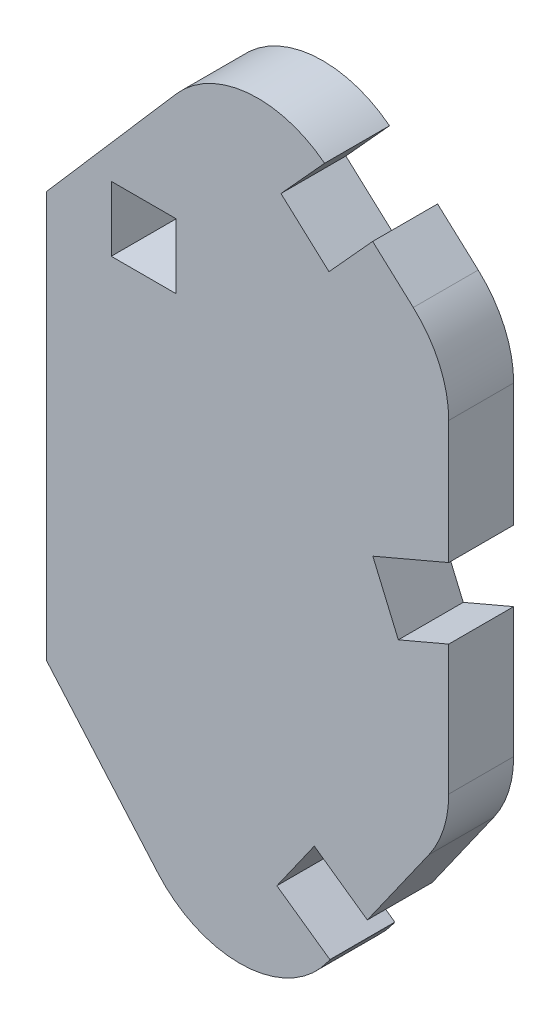
ISO-10303-21;
HEADER;
FILE_DESCRIPTION(('STEP AP214'),'2;1');
FILE_NAME('part.step','',(''),(''),'','','');
FILE_SCHEMA(('AUTOMOTIVE_DESIGN { 1 0 10303 214 1 1 1 1 }'));
ENDSEC;
DATA;
#1=APPLICATION_CONTEXT('core data for automotive mechanical design processes');
#2=APPLICATION_PROTOCOL_DEFINITION('international standard','automotive_design',2000,#1);
#3=PRODUCT_CONTEXT('',#1,'mechanical');
#4=PRODUCT('Part','Part','',(#3));
#5=PRODUCT_RELATED_PRODUCT_CATEGORY('part','',(#4));
#6=PRODUCT_DEFINITION_FORMATION('','',#4);
#7=PRODUCT_DEFINITION_CONTEXT('part definition',#1,'design');
#8=PRODUCT_DEFINITION('design','',#6,#7);
#9=PRODUCT_DEFINITION_SHAPE('','',#8);
#10=(LENGTH_UNIT() NAMED_UNIT(*) SI_UNIT(.MILLI.,.METRE.));
#11=(NAMED_UNIT(*) PLANE_ANGLE_UNIT() SI_UNIT($,.RADIAN.));
#12=(NAMED_UNIT(*) SI_UNIT($,.STERADIAN.) SOLID_ANGLE_UNIT());
#13=UNCERTAINTY_MEASURE_WITH_UNIT(LENGTH_MEASURE(1.E-05),#10,'distance_accuracy_value','');
#14=(GEOMETRIC_REPRESENTATION_CONTEXT(3) GLOBAL_UNCERTAINTY_ASSIGNED_CONTEXT((#13)) GLOBAL_UNIT_ASSIGNED_CONTEXT((#10,
#11,#12)) REPRESENTATION_CONTEXT('',''));
#15=CARTESIAN_POINT('',(0.,0.,0.));
#16=DIRECTION('',(0.,0.,1.));
#17=DIRECTION('',(1.,0.,0.));
#18=AXIS2_PLACEMENT_3D('',#15,#16,#17);
#19=CARTESIAN_POINT('',(0.,0.,1.524));
#20=DIRECTION('',(0.,0.,-1.));
#21=DIRECTION('',(-1.,0.,0.));
#22=AXIS2_PLACEMENT_3D('',#19,#20,#21);
#23=PLANE('',#22);
#24=DIRECTION('',(0.655594715544855,-0.755112951120334,0.));
#25=VECTOR('',#24,1.);
#26=CARTESIAN_POINT('',(1.524,-10.4973080234893,1.524));
#27=LINE('',#26,#25);
#28=CARTESIAN_POINT('',(1.524,-10.4973080234893,1.524));
#29=VERTEX_POINT('',#28);
#30=CARTESIAN_POINT('',(4.14460846819319,-13.5157206909918,1.524));
#31=VERTEX_POINT('',#30);
#32=EDGE_CURVE('E240',#29,#31,#27,.T.);
#33=ORIENTED_EDGE('',*,*,#32,.T.);
#34=CARTESIAN_POINT('',(6.06259536403884,-11.8505101135079,1.524));
#35=DIRECTION('',(0.,0.,-1.));
#36=DIRECTION('',(-1.,0.,0.));
#37=AXIS2_PLACEMENT_3D('',#34,#35,#36);
#38=CIRCLE('',#37,2.54);
#39=CARTESIAN_POINT('',(8.13806446535526,-13.3147600954033,1.524));
#40=VERTEX_POINT('',#39);
#41=EDGE_CURVE('E372',#31,#40,#38,.F.);
#42=ORIENTED_EDGE('',*,*,#41,.T.);
#43=DIRECTION('',(0.576476370824979,0.817113819415913,0.));
#44=VECTOR('',#43,1.);
#45=CARTESIAN_POINT('',(6.26955781361958,-15.9632339688751,1.524));
#46=LINE('',#45,#44);
#47=CARTESIAN_POINT('',(8.18026159895814,-13.2549486915858,1.524));
#48=VERTEX_POINT('',#47);
#49=EDGE_CURVE('E243',#40,#48,#46,.T.);
#50=ORIENTED_EDGE('',*,*,#49,.T.);
#51=DIRECTION('',(-0.817113819415912,0.57647637082498,0.));
#52=VECTOR('',#51,1.);
#53=CARTESIAN_POINT('',(8.18026159895814,-13.2549486915858,1.524));
#54=LINE('',#53,#52);
#55=CARTESIAN_POINT('',(6.93498013816829,-12.3763987024485,1.524));
#56=VERTEX_POINT('',#55);
#57=EDGE_CURVE('E246',#48,#56,#54,.T.);
#58=ORIENTED_EDGE('',*,*,#57,.T.);
#59=DIRECTION('',(0.57647637082498,0.817113819415913,0.));
#60=VECTOR('',#59,1.);
#61=CARTESIAN_POINT('',(7.81353012730556,-11.1311172416587,1.524));
#62=LINE('',#61,#60);
#63=CARTESIAN_POINT('',(7.81353012730556,-11.1311172416587,1.524));
#64=VERTEX_POINT('',#63);
#65=EDGE_CURVE('E248',#56,#64,#62,.T.);
#66=ORIENTED_EDGE('',*,*,#65,.T.);
#67=DIRECTION('',(0.817113819415912,-0.57647637082498,0.));
#68=VECTOR('',#67,1.);
#69=CARTESIAN_POINT('',(9.0588115880954,-12.009667230796,1.524));
#70=LINE('',#69,#68);
#71=CARTESIAN_POINT('',(9.0588115880954,-12.009667230796,1.524));
#72=VERTEX_POINT('',#71);
#73=EDGE_CURVE('E250',#64,#72,#70,.T.);
#74=ORIENTED_EDGE('',*,*,#73,.T.);
#75=DIRECTION('',(0.576476370824979,0.817113819415913,0.));
#76=VECTOR('',#75,1.);
#77=CARTESIAN_POINT('',(9.0588115880954,-12.009667230796,1.524));
#78=LINE('',#77,#76);
#79=CARTESIAN_POINT('',(10.5049844747504,-9.95982111262931,1.524));
#80=VERTEX_POINT('',#79);
#81=EDGE_CURVE('E252',#72,#80,#78,.T.);
#82=ORIENTED_EDGE('',*,*,#81,.T.);
#83=CARTESIAN_POINT('',(8.42951537343396,-8.49557113073387,1.524));
#84=DIRECTION('',(0.,0.,-1.));
#85=DIRECTION('',(-1.,0.,0.));
#86=AXIS2_PLACEMENT_3D('',#83,#84,#85);
#87=CIRCLE('',#86,2.54);
#88=CARTESIAN_POINT('',(10.969515373434,-8.49557113073387,1.524));
#89=VERTEX_POINT('',#88);
#90=EDGE_CURVE('E370',#80,#89,#87,.F.);
#91=ORIENTED_EDGE('',*,*,#90,.T.);
#92=DIRECTION('',(0.,1.,0.));
#93=VECTOR('',#92,1.);
#94=CARTESIAN_POINT('',(10.969515373434,-9.30138195350672,1.524));
#95=LINE('',#94,#93);
#96=CARTESIAN_POINT('',(10.969515373434,-5.44673609900302,1.524));
#97=VERTEX_POINT('',#96);
#98=EDGE_CURVE('E255',#89,#97,#95,.T.);
#99=ORIENTED_EDGE('',*,*,#98,.T.);
#100=DIRECTION('',(-0.919781846056085,-0.392430064681162,0.));
#101=VECTOR('',#100,1.);
#102=CARTESIAN_POINT('',(9.78626543691257,-5.95157629683267,1.524));
#103=LINE('',#102,#101);
#104=CARTESIAN_POINT('',(9.78626543691257,-5.95157629683267,1.524));
#105=VERTEX_POINT('',#104);
#106=EDGE_CURVE('E257',#97,#105,#103,.T.);
#107=ORIENTED_EDGE('',*,*,#106,.T.);
#108=DIRECTION('',(-0.392430064681162,0.919781846056084,0.));
#109=VECTOR('',#108,1.);
#110=CARTESIAN_POINT('',(9.18820201833848,-4.54982876344319,1.524));
#111=LINE('',#110,#109);
#112=CARTESIAN_POINT('',(9.18820201833848,-4.54982876344319,1.524));
#113=VERTEX_POINT('',#112);
#114=EDGE_CURVE('E259',#105,#113,#111,.T.);
#115=ORIENTED_EDGE('',*,*,#114,.T.);
#116=DIRECTION('',(0.919781846056085,0.392430064681162,0.));
#117=VECTOR('',#116,1.);
#118=CARTESIAN_POINT('',(10.969515373434,-3.78982146589221,1.524));
#119=LINE('',#118,#117);
#120=CARTESIAN_POINT('',(10.969515373434,-3.78982146589221,1.524));
#121=VERTEX_POINT('',#120);
#122=EDGE_CURVE('E261',#113,#121,#119,.T.);
#123=ORIENTED_EDGE('',*,*,#122,.T.);
#124=DIRECTION('',(0.,1.,0.));
#125=VECTOR('',#124,1.);
#126=CARTESIAN_POINT('',(10.969515373434,-3.78982146589221,1.524));
#127=LINE('',#126,#125);
#128=CARTESIAN_POINT('',(10.969515373434,-0.900477277610966,1.524));
#129=VERTEX_POINT('',#128);
#130=EDGE_CURVE('E263',#121,#129,#127,.T.);
#131=ORIENTED_EDGE('',*,*,#130,.T.);
#132=CARTESIAN_POINT('',(8.42951537343396,-0.900477277610966,1.524));
#133=DIRECTION('',(0.,0.,-1.));
#134=DIRECTION('',(-1.,0.,0.));
#135=AXIS2_PLACEMENT_3D('',#132,#133,#134);
#136=CIRCLE('',#135,2.54);
#137=CARTESIAN_POINT('',(10.1375153235953,0.979505746314785,1.524));
#138=VERTEX_POINT('',#137);
#139=EDGE_CURVE('E54',#129,#138,#136,.F.);
#140=ORIENTED_EDGE('',*,*,#139,.T.);
#141=DIRECTION('',(-0.740150796821161,0.672440925260353,0.));
#142=VECTOR('',#141,1.);
#143=CARTESIAN_POINT('',(9.1835315007045,1.84621799914652,1.524));
#144=LINE('',#143,#142);
#145=CARTESIAN_POINT('',(9.1835315007045,1.84621799914652,1.524));
#146=VERTEX_POINT('',#145);
#147=EDGE_CURVE('E265',#138,#146,#144,.T.);
#148=ORIENTED_EDGE('',*,*,#147,.T.);
#149=DIRECTION('',(-0.672440925260352,-0.740150796821163,0.));
#150=VECTOR('',#149,1.);
#151=CARTESIAN_POINT('',(9.1835315007045,1.84621799914652,1.524));
#152=LINE('',#151,#150);
#153=CARTESIAN_POINT('',(8.15873153060772,0.718228184791068,1.524));
#154=VERTEX_POINT('',#153);
#155=EDGE_CURVE('E267',#146,#154,#152,.T.);
#156=ORIENTED_EDGE('',*,*,#155,.T.);
#157=DIRECTION('',(-0.740150796821163,0.672440925260351,0.));
#158=VECTOR('',#157,1.);
#159=CARTESIAN_POINT('',(7.03074171625227,1.74302815488784,1.524));
#160=LINE('',#159,#158);
#161=CARTESIAN_POINT('',(7.03074171625227,1.74302815488784,1.524));
#162=VERTEX_POINT('',#161);
#163=EDGE_CURVE('E269',#154,#162,#160,.T.);
#164=ORIENTED_EDGE('',*,*,#163,.T.);
#165=DIRECTION('',(0.672440925260352,0.740150796821162,0.));
#166=VECTOR('',#165,1.);
#167=CARTESIAN_POINT('',(8.05554168634904,2.8710179692433,1.524));
#168=LINE('',#167,#166);
#169=CARTESIAN_POINT('',(8.05554168634904,2.8710179692433,1.524));
#170=VERTEX_POINT('',#169);
#171=EDGE_CURVE('E271',#162,#170,#168,.T.);
#172=ORIENTED_EDGE('',*,*,#171,.T.);
#173=CARTESIAN_POINT('',(6.48879592179813,0.87179119139598,1.524));
#174=DIRECTION('',(0.,0.,-1.));
#175=DIRECTION('',(-1.,0.,0.));
#176=AXIS2_PLACEMENT_3D('',#173,#174,#175);
#177=CIRCLE('',#176,2.54);
#178=CARTESIAN_POINT('',(4.57080902595248,2.53700176887991,1.524));
#179=VERTEX_POINT('',#178);
#180=EDGE_CURVE('E47',#170,#179,#177,.F.);
#181=ORIENTED_EDGE('',*,*,#180,.T.);
#182=DIRECTION('',(-0.655594715544855,-0.755112951120334,0.));
#183=VECTOR('',#182,1.);
#184=CARTESIAN_POINT('',(1.524,-0.972308023489268,1.524));
#185=LINE('',#184,#183);
#186=CARTESIAN_POINT('',(1.524,-0.972308023489268,1.524));
#187=VERTEX_POINT('',#186);
#188=EDGE_CURVE('E273',#179,#187,#185,.T.);
#189=ORIENTED_EDGE('',*,*,#188,.T.);
#190=DIRECTION('',(0.,-1.,0.));
#191=VECTOR('',#190,1.);
#192=CARTESIAN_POINT('',(1.524,-10.4973080234893,1.524));
#193=LINE('',#192,#191);
#194=EDGE_CURVE('E275',#187,#29,#193,.T.);
#195=ORIENTED_EDGE('',*,*,#194,.T.);
#196=EDGE_LOOP('',(#33,#42,#50,#58,#66,#74,#82,#91,#99,#107,#115,#123,#131,#140,#148,#156,#164,
#172,#181,#189,#195));
#197=FACE_BOUND('',#196,.T.);
#198=DIRECTION('',(0.,1.,0.));
#199=VECTOR('',#198,1.);
#200=CARTESIAN_POINT('',(4.572,0.,1.524));
#201=LINE('',#200,#199);
#202=CARTESIAN_POINT('',(4.572,-1.524,1.524));
#203=VERTEX_POINT('',#202);
#204=CARTESIAN_POINT('',(4.572,0.,1.524));
#205=VERTEX_POINT('',#204);
#206=EDGE_CURVE('E199',#203,#205,#201,.T.);
#207=ORIENTED_EDGE('',*,*,#206,.F.);
#208=DIRECTION('',(1.,0.,0.));
#209=VECTOR('',#208,1.);
#210=CARTESIAN_POINT('',(4.572,-1.524,1.524));
#211=LINE('',#210,#209);
#212=CARTESIAN_POINT('',(3.048,-1.524,1.524));
#213=VERTEX_POINT('',#212);
#214=EDGE_CURVE('E224',#213,#203,#211,.T.);
#215=ORIENTED_EDGE('',*,*,#214,.F.);
#216=DIRECTION('',(0.,-1.,0.));
#217=VECTOR('',#216,1.);
#218=CARTESIAN_POINT('',(3.048,0.,1.524));
#219=LINE('',#218,#217);
#220=CARTESIAN_POINT('',(3.048,0.,1.524));
#221=VERTEX_POINT('',#220);
#222=EDGE_CURVE('E222',#221,#213,#219,.T.);
#223=ORIENTED_EDGE('',*,*,#222,.F.);
#224=DIRECTION('',(-1.,0.,0.));
#225=VECTOR('',#224,1.);
#226=CARTESIAN_POINT('',(4.572,0.,1.524));
#227=LINE('',#226,#225);
#228=EDGE_CURVE('E209',#205,#221,#227,.T.);
#229=ORIENTED_EDGE('',*,*,#228,.F.);
#230=EDGE_LOOP('',(#207,#215,#223,#229));
#231=FACE_BOUND('',#230,.T.);
#232=ADVANCED_FACE('F32',(#197,#231),#23,.F.);
#233=CARTESIAN_POINT('',(0.,0.,0.));
#234=DIRECTION('',(0.,0.,-1.));
#235=DIRECTION('',(-1.,0.,0.));
#236=AXIS2_PLACEMENT_3D('',#233,#234,#235);
#237=PLANE('',#236);
#238=DIRECTION('',(0.576476370824979,0.817113819415913,0.));
#239=VECTOR('',#238,1.);
#240=CARTESIAN_POINT('',(6.26955781361958,-15.9632339688751,0.));
#241=LINE('',#240,#239);
#242=CARTESIAN_POINT('',(8.13806446535526,-13.3147600954033,0.));
#243=VERTEX_POINT('',#242);
#244=CARTESIAN_POINT('',(8.18026159895814,-13.2549486915858,0.));
#245=VERTEX_POINT('',#244);
#246=EDGE_CURVE('E280',#243,#245,#241,.T.);
#247=ORIENTED_EDGE('',*,*,#246,.F.);
#248=CARTESIAN_POINT('',(6.06259536403884,-11.8505101135079,0.));
#249=DIRECTION('',(0.,0.,-1.));
#250=DIRECTION('',(-1.,0.,0.));
#251=AXIS2_PLACEMENT_3D('',#248,#249,#250);
#252=CIRCLE('',#251,2.54);
#253=CARTESIAN_POINT('',(4.14460846819319,-13.5157206909918,0.));
#254=VERTEX_POINT('',#253);
#255=EDGE_CURVE('E364',#243,#254,#252,.T.);
#256=ORIENTED_EDGE('',*,*,#255,.T.);
#257=DIRECTION('',(0.655594715544855,-0.755112951120334,0.));
#258=VECTOR('',#257,1.);
#259=CARTESIAN_POINT('',(1.524,-10.4973080234893,0.));
#260=LINE('',#259,#258);
#261=CARTESIAN_POINT('',(1.524,-10.4973080234893,0.));
#262=VERTEX_POINT('',#261);
#263=EDGE_CURVE('E217',#262,#254,#260,.T.);
#264=ORIENTED_EDGE('',*,*,#263,.F.);
#265=DIRECTION('',(0.,-1.,0.));
#266=VECTOR('',#265,1.);
#267=CARTESIAN_POINT('',(1.524,-10.4973080234893,0.));
#268=LINE('',#267,#266);
#269=CARTESIAN_POINT('',(1.524,-0.972308023489268,0.));
#270=VERTEX_POINT('',#269);
#271=EDGE_CURVE('E244',#270,#262,#268,.T.);
#272=ORIENTED_EDGE('',*,*,#271,.F.);
#273=DIRECTION('',(-0.655594715544855,-0.755112951120334,0.));
#274=VECTOR('',#273,1.);
#275=CARTESIAN_POINT('',(1.524,-0.972308023489268,0.));
#276=LINE('',#275,#274);
#277=CARTESIAN_POINT('',(4.57080902595248,2.53700176887991,0.));
#278=VERTEX_POINT('',#277);
#279=EDGE_CURVE('E311',#278,#270,#276,.T.);
#280=ORIENTED_EDGE('',*,*,#279,.F.);
#281=CARTESIAN_POINT('',(6.48879592179813,0.87179119139598,0.));
#282=DIRECTION('',(0.,0.,-1.));
#283=DIRECTION('',(-1.,0.,0.));
#284=AXIS2_PLACEMENT_3D('',#281,#282,#283);
#285=CIRCLE('',#284,2.54);
#286=CARTESIAN_POINT('',(8.05554168634904,2.8710179692433,0.));
#287=VERTEX_POINT('',#286);
#288=EDGE_CURVE('E360',#278,#287,#285,.T.);
#289=ORIENTED_EDGE('',*,*,#288,.T.);
#290=DIRECTION('',(0.672440925260352,0.740150796821162,0.));
#291=VECTOR('',#290,1.);
#292=CARTESIAN_POINT('',(8.05554168634904,2.8710179692433,0.));
#293=LINE('',#292,#291);
#294=CARTESIAN_POINT('',(7.03074171625227,1.74302815488784,0.));
#295=VERTEX_POINT('',#294);
#296=EDGE_CURVE('E308',#295,#287,#293,.T.);
#297=ORIENTED_EDGE('',*,*,#296,.F.);
#298=DIRECTION('',(-0.740150796821163,0.672440925260351,0.));
#299=VECTOR('',#298,1.);
#300=CARTESIAN_POINT('',(7.03074171625227,1.74302815488784,0.));
#301=LINE('',#300,#299);
#302=CARTESIAN_POINT('',(8.15873153060772,0.718228184791068,0.));
#303=VERTEX_POINT('',#302);
#304=EDGE_CURVE('E306',#303,#295,#301,.T.);
#305=ORIENTED_EDGE('',*,*,#304,.F.);
#306=DIRECTION('',(-0.672440925260352,-0.740150796821163,0.));
#307=VECTOR('',#306,1.);
#308=CARTESIAN_POINT('',(9.1835315007045,1.84621799914652,0.));
#309=LINE('',#308,#307);
#310=CARTESIAN_POINT('',(9.1835315007045,1.84621799914652,0.));
#311=VERTEX_POINT('',#310);
#312=EDGE_CURVE('E304',#311,#303,#309,.T.);
#313=ORIENTED_EDGE('',*,*,#312,.F.);
#314=DIRECTION('',(-0.740150796821161,0.672440925260353,0.));
#315=VECTOR('',#314,1.);
#316=CARTESIAN_POINT('',(9.1835315007045,1.84621799914652,0.));
#317=LINE('',#316,#315);
#318=CARTESIAN_POINT('',(10.1375153235953,0.979505746314785,0.));
#319=VERTEX_POINT('',#318);
#320=EDGE_CURVE('E302',#319,#311,#317,.T.);
#321=ORIENTED_EDGE('',*,*,#320,.F.);
#322=CARTESIAN_POINT('',(8.42951537343396,-0.900477277610966,0.));
#323=DIRECTION('',(0.,0.,-1.));
#324=DIRECTION('',(-1.,0.,0.));
#325=AXIS2_PLACEMENT_3D('',#322,#323,#324);
#326=CIRCLE('',#325,2.54);
#327=CARTESIAN_POINT('',(10.969515373434,-0.900477277610966,0.));
#328=VERTEX_POINT('',#327);
#329=EDGE_CURVE('E358',#319,#328,#326,.T.);
#330=ORIENTED_EDGE('',*,*,#329,.T.);
#331=DIRECTION('',(0.,1.,0.));
#332=VECTOR('',#331,1.);
#333=CARTESIAN_POINT('',(10.969515373434,-3.78982146589221,0.));
#334=LINE('',#333,#332);
#335=CARTESIAN_POINT('',(10.969515373434,-3.78982146589221,0.));
#336=VERTEX_POINT('',#335);
#337=EDGE_CURVE('E299',#336,#328,#334,.T.);
#338=ORIENTED_EDGE('',*,*,#337,.F.);
#339=DIRECTION('',(0.919781846056085,0.392430064681162,0.));
#340=VECTOR('',#339,1.);
#341=CARTESIAN_POINT('',(10.969515373434,-3.78982146589221,0.));
#342=LINE('',#341,#340);
#343=CARTESIAN_POINT('',(9.18820201833848,-4.54982876344319,0.));
#344=VERTEX_POINT('',#343);
#345=EDGE_CURVE('E297',#344,#336,#342,.T.);
#346=ORIENTED_EDGE('',*,*,#345,.F.);
#347=DIRECTION('',(-0.392430064681162,0.919781846056084,0.));
#348=VECTOR('',#347,1.);
#349=CARTESIAN_POINT('',(9.18820201833848,-4.54982876344319,0.));
#350=LINE('',#349,#348);
#351=CARTESIAN_POINT('',(9.78626543691257,-5.95157629683267,0.));
#352=VERTEX_POINT('',#351);
#353=EDGE_CURVE('E295',#352,#344,#350,.T.);
#354=ORIENTED_EDGE('',*,*,#353,.F.);
#355=DIRECTION('',(-0.919781846056085,-0.392430064681162,0.));
#356=VECTOR('',#355,1.);
#357=CARTESIAN_POINT('',(9.78626543691257,-5.95157629683267,0.));
#358=LINE('',#357,#356);
#359=CARTESIAN_POINT('',(10.969515373434,-5.44673609900302,0.));
#360=VERTEX_POINT('',#359);
#361=EDGE_CURVE('E293',#360,#352,#358,.T.);
#362=ORIENTED_EDGE('',*,*,#361,.F.);
#363=DIRECTION('',(0.,1.,0.));
#364=VECTOR('',#363,1.);
#365=CARTESIAN_POINT('',(10.969515373434,-9.30138195350672,0.));
#366=LINE('',#365,#364);
#367=CARTESIAN_POINT('',(10.969515373434,-8.49557113073387,0.));
#368=VERTEX_POINT('',#367);
#369=EDGE_CURVE('E291',#368,#360,#366,.T.);
#370=ORIENTED_EDGE('',*,*,#369,.F.);
#371=CARTESIAN_POINT('',(8.42951537343396,-8.49557113073387,0.));
#372=DIRECTION('',(0.,0.,-1.));
#373=DIRECTION('',(-1.,0.,0.));
#374=AXIS2_PLACEMENT_3D('',#371,#372,#373);
#375=CIRCLE('',#374,2.54);
#376=CARTESIAN_POINT('',(10.5049844747504,-9.95982111262931,0.));
#377=VERTEX_POINT('',#376);
#378=EDGE_CURVE('E362',#368,#377,#375,.T.);
#379=ORIENTED_EDGE('',*,*,#378,.T.);
#380=DIRECTION('',(0.576476370824979,0.817113819415913,0.));
#381=VECTOR('',#380,1.);
#382=CARTESIAN_POINT('',(9.0588115880954,-12.009667230796,0.));
#383=LINE('',#382,#381);
#384=CARTESIAN_POINT('',(9.0588115880954,-12.009667230796,0.));
#385=VERTEX_POINT('',#384);
#386=EDGE_CURVE('E288',#385,#377,#383,.T.);
#387=ORIENTED_EDGE('',*,*,#386,.F.);
#388=DIRECTION('',(0.817113819415912,-0.57647637082498,0.));
#389=VECTOR('',#388,1.);
#390=CARTESIAN_POINT('',(9.0588115880954,-12.009667230796,0.));
#391=LINE('',#390,#389);
#392=CARTESIAN_POINT('',(7.81353012730556,-11.1311172416587,0.));
#393=VERTEX_POINT('',#392);
#394=EDGE_CURVE('E286',#393,#385,#391,.T.);
#395=ORIENTED_EDGE('',*,*,#394,.F.);
#396=DIRECTION('',(0.57647637082498,0.817113819415913,0.));
#397=VECTOR('',#396,1.);
#398=CARTESIAN_POINT('',(7.81353012730556,-11.1311172416587,0.));
#399=LINE('',#398,#397);
#400=CARTESIAN_POINT('',(6.93498013816829,-12.3763987024485,0.));
#401=VERTEX_POINT('',#400);
#402=EDGE_CURVE('E284',#401,#393,#399,.T.);
#403=ORIENTED_EDGE('',*,*,#402,.F.);
#404=DIRECTION('',(-0.817113819415912,0.57647637082498,0.));
#405=VECTOR('',#404,1.);
#406=CARTESIAN_POINT('',(8.18026159895814,-13.2549486915858,0.));
#407=LINE('',#406,#405);
#408=EDGE_CURVE('E282',#245,#401,#407,.T.);
#409=ORIENTED_EDGE('',*,*,#408,.F.);
#410=EDGE_LOOP('',(#247,#256,#264,#272,#280,#289,#297,#305,#313,#321,#330,#338,#346,#354,#362,
#370,#379,#387,#395,#403,#409));
#411=FACE_BOUND('',#410,.T.);
#412=DIRECTION('',(1.,0.,0.));
#413=VECTOR('',#412,1.);
#414=CARTESIAN_POINT('',(4.572,-1.524,0.));
#415=LINE('',#414,#413);
#416=CARTESIAN_POINT('',(3.048,-1.524,0.));
#417=VERTEX_POINT('',#416);
#418=CARTESIAN_POINT('',(4.572,-1.524,0.));
#419=VERTEX_POINT('',#418);
#420=EDGE_CURVE('E210',#417,#419,#415,.T.);
#421=ORIENTED_EDGE('',*,*,#420,.T.);
#422=DIRECTION('',(0.,1.,0.));
#423=VECTOR('',#422,1.);
#424=CARTESIAN_POINT('',(4.572,0.,0.));
#425=LINE('',#424,#423);
#426=CARTESIAN_POINT('',(4.572,0.,0.));
#427=VERTEX_POINT('',#426);
#428=EDGE_CURVE('E228',#419,#427,#425,.T.);
#429=ORIENTED_EDGE('',*,*,#428,.T.);
#430=DIRECTION('',(-1.,0.,0.));
#431=VECTOR('',#430,1.);
#432=CARTESIAN_POINT('',(4.572,0.,0.));
#433=LINE('',#432,#431);
#434=CARTESIAN_POINT('',(3.048,0.,0.));
#435=VERTEX_POINT('',#434);
#436=EDGE_CURVE('E216',#427,#435,#433,.T.);
#437=ORIENTED_EDGE('',*,*,#436,.T.);
#438=DIRECTION('',(0.,-1.,0.));
#439=VECTOR('',#438,1.);
#440=CARTESIAN_POINT('',(3.048,0.,0.));
#441=LINE('',#440,#439);
#442=EDGE_CURVE('E231',#435,#417,#441,.T.);
#443=ORIENTED_EDGE('',*,*,#442,.T.);
#444=EDGE_LOOP('',(#421,#429,#437,#443));
#445=FACE_BOUND('',#444,.T.);
#446=ADVANCED_FACE('F391',(#411,#445),#237,.T.);
#447=CARTESIAN_POINT('',(1.524,-10.4973080234893,1.524));
#448=DIRECTION('',(0.755112951120334,0.655594715544855,0.));
#449=DIRECTION('',(-0.655594715544855,0.755112951120334,0.));
#450=AXIS2_PLACEMENT_3D('',#447,#448,#449);
#451=PLANE('',#450);
#452=ORIENTED_EDGE('',*,*,#263,.T.);
#453=DIRECTION('',(0.,0.,-1.));
#454=VECTOR('',#453,1.);
#455=CARTESIAN_POINT('',(4.14460846819319,-13.5157206909918,1.524));
#456=LINE('',#455,#454);
#457=EDGE_CURVE('E366',#254,#31,#456,.F.);
#458=ORIENTED_EDGE('',*,*,#457,.T.);
#459=ORIENTED_EDGE('',*,*,#32,.F.);
#460=DIRECTION('',(0.,0.,-1.));
#461=VECTOR('',#460,1.);
#462=CARTESIAN_POINT('',(1.524,-10.4973080234893,1.524));
#463=LINE('',#462,#461);
#464=EDGE_CURVE('E277',#29,#262,#463,.T.);
#465=ORIENTED_EDGE('',*,*,#464,.T.);
#466=EDGE_LOOP('',(#452,#458,#459,#465));
#467=FACE_BOUND('',#466,.T.);
#468=ADVANCED_FACE('F423',(#467),#451,.F.);
#469=CARTESIAN_POINT('',(6.26955781361958,-15.9632339688751,1.524));
#470=DIRECTION('',(-0.817113819415913,0.576476370824979,0.));
#471=DIRECTION('',(-0.576476370824979,-0.817113819415913,0.));
#472=AXIS2_PLACEMENT_3D('',#469,#470,#471);
#473=PLANE('',#472);
#474=ORIENTED_EDGE('',*,*,#49,.F.);
#475=DIRECTION('',(0.,0.,-1.));
#476=VECTOR('',#475,1.);
#477=CARTESIAN_POINT('',(8.13806446535526,-13.3147600954033,1.524));
#478=LINE('',#477,#476);
#479=EDGE_CURVE('E355',#40,#243,#478,.T.);
#480=ORIENTED_EDGE('',*,*,#479,.T.);
#481=ORIENTED_EDGE('',*,*,#246,.T.);
#482=DIRECTION('',(0.,0.,-1.));
#483=VECTOR('',#482,1.);
#484=CARTESIAN_POINT('',(8.18026159895814,-13.2549486915858,1.524));
#485=LINE('',#484,#483);
#486=EDGE_CURVE('E352',#48,#245,#485,.T.);
#487=ORIENTED_EDGE('',*,*,#486,.F.);
#488=EDGE_LOOP('',(#474,#480,#481,#487));
#489=FACE_BOUND('',#488,.T.);
#490=ADVANCED_FACE('F431',(#489),#473,.F.);
#491=CARTESIAN_POINT('',(8.18026159895814,-13.2549486915858,1.524));
#492=DIRECTION('',(-0.57647637082498,-0.817113819415912,0.));
#493=DIRECTION('',(0.817113819415913,-0.57647637082498,0.));
#494=AXIS2_PLACEMENT_3D('',#491,#492,#493);
#495=PLANE('',#494);
#496=ORIENTED_EDGE('',*,*,#408,.T.);
#497=DIRECTION('',(0.,0.,-1.));
#498=VECTOR('',#497,1.);
#499=CARTESIAN_POINT('',(6.93498013816829,-12.3763987024485,1.524));
#500=LINE('',#499,#498);
#501=EDGE_CURVE('E349',#56,#401,#500,.T.);
#502=ORIENTED_EDGE('',*,*,#501,.F.);
#503=ORIENTED_EDGE('',*,*,#57,.F.);
#504=ORIENTED_EDGE('',*,*,#486,.T.);
#505=EDGE_LOOP('',(#496,#502,#503,#504));
#506=FACE_BOUND('',#505,.T.);
#507=ADVANCED_FACE('F438',(#506),#495,.F.);
#508=CARTESIAN_POINT('',(7.81353012730556,-11.1311172416587,1.524));
#509=DIRECTION('',(-0.817113819415913,0.57647637082498,0.));
#510=DIRECTION('',(-0.57647637082498,-0.817113819415913,0.));
#511=AXIS2_PLACEMENT_3D('',#508,#509,#510);
#512=PLANE('',#511);
#513=ORIENTED_EDGE('',*,*,#402,.T.);
#514=DIRECTION('',(0.,0.,-1.));
#515=VECTOR('',#514,1.);
#516=CARTESIAN_POINT('',(7.81353012730556,-11.1311172416587,1.524));
#517=LINE('',#516,#515);
#518=EDGE_CURVE('E346',#64,#393,#517,.T.);
#519=ORIENTED_EDGE('',*,*,#518,.F.);
#520=ORIENTED_EDGE('',*,*,#65,.F.);
#521=ORIENTED_EDGE('',*,*,#501,.T.);
#522=EDGE_LOOP('',(#513,#519,#520,#521));
#523=FACE_BOUND('',#522,.T.);
#524=ADVANCED_FACE('F442',(#523),#512,.F.);
#525=CARTESIAN_POINT('',(9.0588115880954,-12.009667230796,1.524));
#526=DIRECTION('',(0.57647637082498,0.817113819415912,0.));
#527=DIRECTION('',(-0.817113819415912,0.57647637082498,0.));
#528=AXIS2_PLACEMENT_3D('',#525,#526,#527);
#529=PLANE('',#528);
#530=ORIENTED_EDGE('',*,*,#394,.T.);
#531=DIRECTION('',(0.,0.,-1.));
#532=VECTOR('',#531,1.);
#533=CARTESIAN_POINT('',(9.0588115880954,-12.009667230796,1.524));
#534=LINE('',#533,#532);
#535=EDGE_CURVE('E343',#72,#385,#534,.T.);
#536=ORIENTED_EDGE('',*,*,#535,.F.);
#537=ORIENTED_EDGE('',*,*,#73,.F.);
#538=ORIENTED_EDGE('',*,*,#518,.T.);
#539=EDGE_LOOP('',(#530,#536,#537,#538));
#540=FACE_BOUND('',#539,.T.);
#541=ADVANCED_FACE('F449',(#540),#529,.F.);
#542=CARTESIAN_POINT('',(9.0588115880954,-12.009667230796,1.524));
#543=DIRECTION('',(-0.817113819415913,0.576476370824979,0.));
#544=DIRECTION('',(-0.576476370824979,-0.817113819415913,0.));
#545=AXIS2_PLACEMENT_3D('',#542,#543,#544);
#546=PLANE('',#545);
#547=ORIENTED_EDGE('',*,*,#386,.T.);
#548=DIRECTION('',(0.,0.,-1.));
#549=VECTOR('',#548,1.);
#550=CARTESIAN_POINT('',(10.5049844747504,-9.95982111262931,1.524));
#551=LINE('',#550,#549);
#552=EDGE_CURVE('E377',#377,#80,#551,.F.);
#553=ORIENTED_EDGE('',*,*,#552,.T.);
#554=ORIENTED_EDGE('',*,*,#81,.F.);
#555=ORIENTED_EDGE('',*,*,#535,.T.);
#556=EDGE_LOOP('',(#547,#553,#554,#555));
#557=FACE_BOUND('',#556,.T.);
#558=ADVANCED_FACE('F452',(#557),#546,.F.);
#559=CARTESIAN_POINT('',(10.969515373434,-9.30138195350672,1.524));
#560=DIRECTION('',(-1.,0.,0.));
#561=DIRECTION('',(0.,0.,1.));
#562=AXIS2_PLACEMENT_3D('',#559,#560,#561);
#563=PLANE('',#562);
#564=ORIENTED_EDGE('',*,*,#98,.F.);
#565=DIRECTION('',(0.,0.,-1.));
#566=VECTOR('',#565,1.);
#567=CARTESIAN_POINT('',(10.969515373434,-8.49557113073387,1.524));
#568=LINE('',#567,#566);
#569=EDGE_CURVE('E374',#89,#368,#568,.T.);
#570=ORIENTED_EDGE('',*,*,#569,.T.);
#571=ORIENTED_EDGE('',*,*,#369,.T.);
#572=DIRECTION('',(0.,0.,-1.));
#573=VECTOR('',#572,1.);
#574=CARTESIAN_POINT('',(10.969515373434,-5.44673609900302,1.524));
#575=LINE('',#574,#573);
#576=EDGE_CURVE('E340',#97,#360,#575,.T.);
#577=ORIENTED_EDGE('',*,*,#576,.F.);
#578=EDGE_LOOP('',(#564,#570,#571,#577));
#579=FACE_BOUND('',#578,.T.);
#580=ADVANCED_FACE('F460',(#579),#563,.F.);
#581=CARTESIAN_POINT('',(9.78626543691257,-5.95157629683267,1.524));
#582=DIRECTION('',(0.392430064681162,-0.919781846056084,0.));
#583=DIRECTION('',(0.919781846056085,0.392430064681162,0.));
#584=AXIS2_PLACEMENT_3D('',#581,#582,#583);
#585=PLANE('',#584);
#586=ORIENTED_EDGE('',*,*,#361,.T.);
#587=DIRECTION('',(0.,0.,-1.));
#588=VECTOR('',#587,1.);
#589=CARTESIAN_POINT('',(9.78626543691257,-5.95157629683267,1.524));
#590=LINE('',#589,#588);
#591=EDGE_CURVE('E337',#105,#352,#590,.T.);
#592=ORIENTED_EDGE('',*,*,#591,.F.);
#593=ORIENTED_EDGE('',*,*,#106,.F.);
#594=ORIENTED_EDGE('',*,*,#576,.T.);
#595=EDGE_LOOP('',(#586,#592,#593,#594));
#596=FACE_BOUND('',#595,.T.);
#597=ADVANCED_FACE('F466',(#596),#585,.F.);
#598=CARTESIAN_POINT('',(9.18820201833848,-4.54982876344319,1.524));
#599=DIRECTION('',(-0.919781846056084,-0.392430064681162,0.));
#600=DIRECTION('',(0.392430064681162,-0.919781846056085,0.));
#601=AXIS2_PLACEMENT_3D('',#598,#599,#600);
#602=PLANE('',#601);
#603=ORIENTED_EDGE('',*,*,#353,.T.);
#604=DIRECTION('',(0.,0.,-1.));
#605=VECTOR('',#604,1.);
#606=CARTESIAN_POINT('',(9.18820201833848,-4.54982876344319,1.524));
#607=LINE('',#606,#605);
#608=EDGE_CURVE('E334',#113,#344,#607,.T.);
#609=ORIENTED_EDGE('',*,*,#608,.F.);
#610=ORIENTED_EDGE('',*,*,#114,.F.);
#611=ORIENTED_EDGE('',*,*,#591,.T.);
#612=EDGE_LOOP('',(#603,#609,#610,#611));
#613=FACE_BOUND('',#612,.T.);
#614=ADVANCED_FACE('F472',(#613),#602,.F.);
#615=CARTESIAN_POINT('',(10.969515373434,-3.78982146589221,1.524));
#616=DIRECTION('',(-0.392430064681162,0.919781846056084,0.));
#617=DIRECTION('',(-0.919781846056085,-0.392430064681162,0.));
#618=AXIS2_PLACEMENT_3D('',#615,#616,#617);
#619=PLANE('',#618);
#620=ORIENTED_EDGE('',*,*,#345,.T.);
#621=DIRECTION('',(0.,0.,-1.));
#622=VECTOR('',#621,1.);
#623=CARTESIAN_POINT('',(10.969515373434,-3.78982146589221,1.524));
#624=LINE('',#623,#622);
#625=EDGE_CURVE('E331',#121,#336,#624,.T.);
#626=ORIENTED_EDGE('',*,*,#625,.F.);
#627=ORIENTED_EDGE('',*,*,#122,.F.);
#628=ORIENTED_EDGE('',*,*,#608,.T.);
#629=EDGE_LOOP('',(#620,#626,#627,#628));
#630=FACE_BOUND('',#629,.T.);
#631=ADVANCED_FACE('F476',(#630),#619,.F.);
#632=CARTESIAN_POINT('',(10.969515373434,-3.78982146589221,1.524));
#633=DIRECTION('',(-1.,0.,0.));
#634=DIRECTION('',(0.,0.,1.));
#635=AXIS2_PLACEMENT_3D('',#632,#633,#634);
#636=PLANE('',#635);
#637=ORIENTED_EDGE('',*,*,#337,.T.);
#638=DIRECTION('',(0.,0.,-1.));
#639=VECTOR('',#638,1.);
#640=CARTESIAN_POINT('',(10.969515373434,-0.900477277610966,1.524));
#641=LINE('',#640,#639);
#642=EDGE_CURVE('E11',#328,#129,#641,.F.);
#643=ORIENTED_EDGE('',*,*,#642,.T.);
#644=ORIENTED_EDGE('',*,*,#130,.F.);
#645=ORIENTED_EDGE('',*,*,#625,.T.);
#646=EDGE_LOOP('',(#637,#643,#644,#645));
#647=FACE_BOUND('',#646,.T.);
#648=ADVANCED_FACE('F479',(#647),#636,.F.);
#649=CARTESIAN_POINT('',(9.1835315007045,1.84621799914652,1.524));
#650=DIRECTION('',(-0.672440925260353,-0.740150796821161,0.));
#651=DIRECTION('',(0.740150796821161,-0.672440925260353,0.));
#652=AXIS2_PLACEMENT_3D('',#649,#650,#651);
#653=PLANE('',#652);
#654=ORIENTED_EDGE('',*,*,#147,.F.);
#655=DIRECTION('',(0.,0.,-1.));
#656=VECTOR('',#655,1.);
#657=CARTESIAN_POINT('',(10.1375153235953,0.979505746314784,1.524));
#658=LINE('',#657,#656);
#659=EDGE_CURVE('E40',#138,#319,#658,.T.);
#660=ORIENTED_EDGE('',*,*,#659,.T.);
#661=ORIENTED_EDGE('',*,*,#320,.T.);
#662=DIRECTION('',(0.,0.,-1.));
#663=VECTOR('',#662,1.);
#664=CARTESIAN_POINT('',(9.1835315007045,1.84621799914652,1.524));
#665=LINE('',#664,#663);
#666=EDGE_CURVE('E328',#146,#311,#665,.T.);
#667=ORIENTED_EDGE('',*,*,#666,.F.);
#668=EDGE_LOOP('',(#654,#660,#661,#667));
#669=FACE_BOUND('',#668,.T.);
#670=ADVANCED_FACE('F385',(#669),#653,.F.);
#671=CARTESIAN_POINT('',(9.1835315007045,1.84621799914652,1.524));
#672=DIRECTION('',(0.740150796821163,-0.672440925260351,0.));
#673=DIRECTION('',(0.672440925260352,0.740150796821163,0.));
#674=AXIS2_PLACEMENT_3D('',#671,#672,#673);
#675=PLANE('',#674);
#676=ORIENTED_EDGE('',*,*,#312,.T.);
#677=DIRECTION('',(0.,0.,-1.));
#678=VECTOR('',#677,1.);
#679=CARTESIAN_POINT('',(8.15873153060772,0.718228184791068,1.524));
#680=LINE('',#679,#678);
#681=EDGE_CURVE('E325',#154,#303,#680,.T.);
#682=ORIENTED_EDGE('',*,*,#681,.F.);
#683=ORIENTED_EDGE('',*,*,#155,.F.);
#684=ORIENTED_EDGE('',*,*,#666,.T.);
#685=EDGE_LOOP('',(#676,#682,#683,#684));
#686=FACE_BOUND('',#685,.T.);
#687=ADVANCED_FACE('F398',(#686),#675,.F.);
#688=CARTESIAN_POINT('',(7.03074171625227,1.74302815488784,1.524));
#689=DIRECTION('',(-0.672440925260351,-0.740150796821163,0.));
#690=DIRECTION('',(0.740150796821163,-0.672440925260352,0.));
#691=AXIS2_PLACEMENT_3D('',#688,#689,#690);
#692=PLANE('',#691);
#693=ORIENTED_EDGE('',*,*,#304,.T.);
#694=DIRECTION('',(0.,0.,-1.));
#695=VECTOR('',#694,1.);
#696=CARTESIAN_POINT('',(7.03074171625227,1.74302815488784,1.524));
#697=LINE('',#696,#695);
#698=EDGE_CURVE('E322',#162,#295,#697,.T.);
#699=ORIENTED_EDGE('',*,*,#698,.F.);
#700=ORIENTED_EDGE('',*,*,#163,.F.);
#701=ORIENTED_EDGE('',*,*,#681,.T.);
#702=EDGE_LOOP('',(#693,#699,#700,#701));
#703=FACE_BOUND('',#702,.T.);
#704=ADVANCED_FACE('F402',(#703),#692,.F.);
#705=CARTESIAN_POINT('',(8.05554168634904,2.8710179692433,1.524));
#706=DIRECTION('',(-0.740150796821162,0.672440925260352,0.));
#707=DIRECTION('',(-0.672440925260352,-0.740150796821163,0.));
#708=AXIS2_PLACEMENT_3D('',#705,#706,#707);
#709=PLANE('',#708);
#710=ORIENTED_EDGE('',*,*,#296,.T.);
#711=DIRECTION('',(0.,0.,-1.));
#712=VECTOR('',#711,1.);
#713=CARTESIAN_POINT('',(8.05554168634904,2.8710179692433,1.524));
#714=LINE('',#713,#712);
#715=EDGE_CURVE('E319',#170,#287,#714,.T.);
#716=ORIENTED_EDGE('',*,*,#715,.F.);
#717=ORIENTED_EDGE('',*,*,#171,.F.);
#718=ORIENTED_EDGE('',*,*,#698,.T.);
#719=EDGE_LOOP('',(#710,#716,#717,#718));
#720=FACE_BOUND('',#719,.T.);
#721=ADVANCED_FACE('F407',(#720),#709,.F.);
#722=CARTESIAN_POINT('',(1.524,-0.972308023489268,1.524));
#723=DIRECTION('',(0.755112951120334,-0.655594715544855,0.));
#724=DIRECTION('',(0.655594715544855,0.755112951120334,0.));
#725=AXIS2_PLACEMENT_3D('',#722,#723,#724);
#726=PLANE('',#725);
#727=ORIENTED_EDGE('',*,*,#188,.F.);
#728=DIRECTION('',(0.,0.,-1.));
#729=VECTOR('',#728,1.);
#730=CARTESIAN_POINT('',(4.57080902595248,2.53700176887991,1.524));
#731=LINE('',#730,#729);
#732=EDGE_CURVE('E379',#179,#278,#731,.T.);
#733=ORIENTED_EDGE('',*,*,#732,.T.);
#734=ORIENTED_EDGE('',*,*,#279,.T.);
#735=DIRECTION('',(0.,0.,-1.));
#736=VECTOR('',#735,1.);
#737=CARTESIAN_POINT('',(1.524,-0.972308023489268,1.524));
#738=LINE('',#737,#736);
#739=EDGE_CURVE('E316',#187,#270,#738,.T.);
#740=ORIENTED_EDGE('',*,*,#739,.F.);
#741=EDGE_LOOP('',(#727,#733,#734,#740));
#742=FACE_BOUND('',#741,.T.);
#743=ADVANCED_FACE('F413',(#742),#726,.F.);
#744=CARTESIAN_POINT('',(1.524,-10.4973080234893,1.524));
#745=DIRECTION('',(1.,0.,0.));
#746=DIRECTION('',(0.,1.,0.));
#747=AXIS2_PLACEMENT_3D('',#744,#745,#746);
#748=PLANE('',#747);
#749=ORIENTED_EDGE('',*,*,#271,.T.);
#750=ORIENTED_EDGE('',*,*,#464,.F.);
#751=ORIENTED_EDGE('',*,*,#194,.F.);
#752=ORIENTED_EDGE('',*,*,#739,.T.);
#753=EDGE_LOOP('',(#749,#750,#751,#752));
#754=FACE_BOUND('',#753,.T.);
#755=ADVANCED_FACE('F419',(#754),#748,.F.);
#756=CARTESIAN_POINT('',(4.572,0.,1.524));
#757=DIRECTION('',(-1.,0.,0.));
#758=DIRECTION('',(0.,0.,1.));
#759=AXIS2_PLACEMENT_3D('',#756,#757,#758);
#760=PLANE('',#759);
#761=ORIENTED_EDGE('',*,*,#428,.F.);
#762=DIRECTION('',(0.,0.,-1.));
#763=VECTOR('',#762,1.);
#764=CARTESIAN_POINT('',(4.572,-1.524,1.524));
#765=LINE('',#764,#763);
#766=EDGE_CURVE('E205',#203,#419,#765,.T.);
#767=ORIENTED_EDGE('',*,*,#766,.F.);
#768=ORIENTED_EDGE('',*,*,#206,.T.);
#769=DIRECTION('',(0.,0.,-1.));
#770=VECTOR('',#769,1.);
#771=CARTESIAN_POINT('',(4.572,0.,1.524));
#772=LINE('',#771,#770);
#773=EDGE_CURVE('E202',#205,#427,#772,.T.);
#774=ORIENTED_EDGE('',*,*,#773,.T.);
#775=EDGE_LOOP('',(#761,#767,#768,#774));
#776=FACE_BOUND('',#775,.T.);
#777=ADVANCED_FACE('F201',(#776),#760,.T.);
#778=CARTESIAN_POINT('',(4.572,0.,1.524));
#779=DIRECTION('',(0.,-1.,0.));
#780=DIRECTION('',(1.,0.,0.));
#781=AXIS2_PLACEMENT_3D('',#778,#779,#780);
#782=PLANE('',#781);
#783=ORIENTED_EDGE('',*,*,#436,.F.);
#784=ORIENTED_EDGE('',*,*,#773,.F.);
#785=ORIENTED_EDGE('',*,*,#228,.T.);
#786=DIRECTION('',(0.,0.,-1.));
#787=VECTOR('',#786,1.);
#788=CARTESIAN_POINT('',(3.048,0.,1.524));
#789=LINE('',#788,#787);
#790=EDGE_CURVE('E218',#221,#435,#789,.T.);
#791=ORIENTED_EDGE('',*,*,#790,.T.);
#792=EDGE_LOOP('',(#783,#784,#785,#791));
#793=FACE_BOUND('',#792,.T.);
#794=ADVANCED_FACE('F213',(#793),#782,.T.);
#795=CARTESIAN_POINT('',(3.048,0.,1.524));
#796=DIRECTION('',(1.,0.,0.));
#797=DIRECTION('',(0.,0.,-1.));
#798=AXIS2_PLACEMENT_3D('',#795,#796,#797);
#799=PLANE('',#798);
#800=ORIENTED_EDGE('',*,*,#442,.F.);
#801=ORIENTED_EDGE('',*,*,#790,.F.);
#802=ORIENTED_EDGE('',*,*,#222,.T.);
#803=DIRECTION('',(0.,0.,-1.));
#804=VECTOR('',#803,1.);
#805=CARTESIAN_POINT('',(3.048,-1.524,1.524));
#806=LINE('',#805,#804);
#807=EDGE_CURVE('E237',#213,#417,#806,.T.);
#808=ORIENTED_EDGE('',*,*,#807,.T.);
#809=EDGE_LOOP('',(#800,#801,#802,#808));
#810=FACE_BOUND('',#809,.T.);
#811=ADVANCED_FACE('F561',(#810),#799,.T.);
#812=CARTESIAN_POINT('',(4.572,-1.524,1.524));
#813=DIRECTION('',(0.,1.,0.));
#814=DIRECTION('',(0.,0.,1.));
#815=AXIS2_PLACEMENT_3D('',#812,#813,#814);
#816=PLANE('',#815);
#817=ORIENTED_EDGE('',*,*,#420,.F.);
#818=ORIENTED_EDGE('',*,*,#807,.F.);
#819=ORIENTED_EDGE('',*,*,#214,.T.);
#820=ORIENTED_EDGE('',*,*,#766,.T.);
#821=EDGE_LOOP('',(#817,#818,#819,#820));
#822=FACE_BOUND('',#821,.T.);
#823=ADVANCED_FACE('F530',(#822),#816,.T.);
#824=CARTESIAN_POINT('',(6.06259536403884,-11.8505101135079,1.524));
#825=DIRECTION('',(0.,0.,-1.));
#826=DIRECTION('',(-1.,0.,0.));
#827=AXIS2_PLACEMENT_3D('',#824,#825,#826);
#828=CYLINDRICAL_SURFACE('',#827,2.54);
#829=ORIENTED_EDGE('',*,*,#41,.F.);
#830=ORIENTED_EDGE('',*,*,#457,.F.);
#831=ORIENTED_EDGE('',*,*,#255,.F.);
#832=ORIENTED_EDGE('',*,*,#479,.F.);
#833=EDGE_LOOP('',(#829,#830,#831,#832));
#834=FACE_BOUND('',#833,.T.);
#835=ADVANCED_FACE('F429',(#834),#828,.T.);
#836=CARTESIAN_POINT('',(8.42951537343396,-8.49557113073387,1.524));
#837=DIRECTION('',(0.,0.,-1.));
#838=DIRECTION('',(-1.,0.,0.));
#839=AXIS2_PLACEMENT_3D('',#836,#837,#838);
#840=CYLINDRICAL_SURFACE('',#839,2.54);
#841=ORIENTED_EDGE('',*,*,#90,.F.);
#842=ORIENTED_EDGE('',*,*,#552,.F.);
#843=ORIENTED_EDGE('',*,*,#378,.F.);
#844=ORIENTED_EDGE('',*,*,#569,.F.);
#845=EDGE_LOOP('',(#841,#842,#843,#844));
#846=FACE_BOUND('',#845,.T.);
#847=ADVANCED_FACE('F455',(#846),#840,.T.);
#848=CARTESIAN_POINT('',(6.48879592179813,0.87179119139598,1.524));
#849=DIRECTION('',(0.,0.,-1.));
#850=DIRECTION('',(-1.,0.,0.));
#851=AXIS2_PLACEMENT_3D('',#848,#849,#850);
#852=CYLINDRICAL_SURFACE('',#851,2.54);
#853=ORIENTED_EDGE('',*,*,#180,.F.);
#854=ORIENTED_EDGE('',*,*,#715,.T.);
#855=ORIENTED_EDGE('',*,*,#288,.F.);
#856=ORIENTED_EDGE('',*,*,#732,.F.);
#857=EDGE_LOOP('',(#853,#854,#855,#856));
#858=FACE_BOUND('',#857,.T.);
#859=ADVANCED_FACE('F410',(#858),#852,.T.);
#860=CARTESIAN_POINT('',(8.42951537343396,-0.900477277610966,1.524));
#861=DIRECTION('',(0.,0.,-1.));
#862=DIRECTION('',(-1.,0.,0.));
#863=AXIS2_PLACEMENT_3D('',#860,#861,#862);
#864=CYLINDRICAL_SURFACE('',#863,2.54);
#865=ORIENTED_EDGE('',*,*,#139,.F.);
#866=ORIENTED_EDGE('',*,*,#642,.F.);
#867=ORIENTED_EDGE('',*,*,#329,.F.);
#868=ORIENTED_EDGE('',*,*,#659,.F.);
#869=EDGE_LOOP('',(#865,#866,#867,#868));
#870=FACE_BOUND('',#869,.T.);
#871=ADVANCED_FACE('F34',(#870),#864,.T.);
#872=CLOSED_SHELL('',(#232,#446,#468,#490,#507,#524,#541,#558,#580,#597,#614,#631,#648,#670,
#687,#704,#721,#743,#755,#777,#794,#811,#823,#835,#847,#859,#871));
#873=MANIFOLD_SOLID_BREP('B2',#872);
#874=ADVANCED_BREP_SHAPE_REPRESENTATION('',(#18,#873),#14);
#875=SHAPE_DEFINITION_REPRESENTATION(#9,#874);
ENDSEC;
END-ISO-10303-21;
